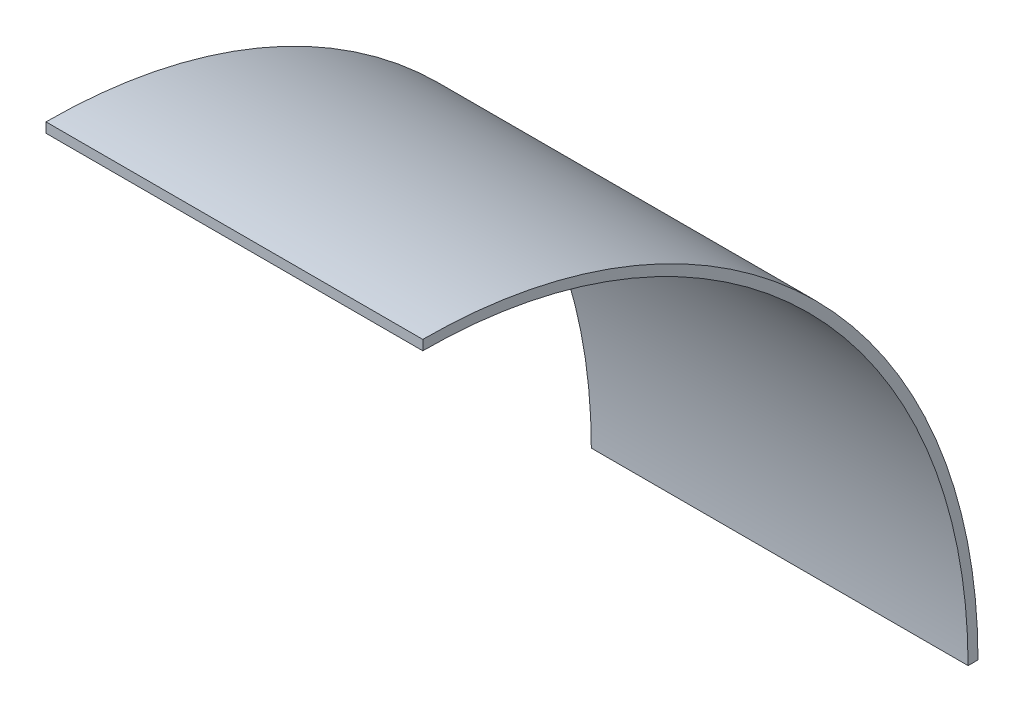
ISO-10303-21;
HEADER;
FILE_DESCRIPTION(('STEP AP214'),'2;1');
FILE_NAME('part.step','',(''),(''),'','','');
FILE_SCHEMA(('AUTOMOTIVE_DESIGN { 1 0 10303 214 1 1 1 1 }'));
ENDSEC;
DATA;
#1=APPLICATION_CONTEXT('core data for automotive mechanical design processes');
#2=APPLICATION_PROTOCOL_DEFINITION('international standard','automotive_design',2000,#1);
#3=PRODUCT_CONTEXT('',#1,'mechanical');
#4=PRODUCT('Part','Part','',(#3));
#5=PRODUCT_RELATED_PRODUCT_CATEGORY('part','',(#4));
#6=PRODUCT_DEFINITION_FORMATION('','',#4);
#7=PRODUCT_DEFINITION_CONTEXT('part definition',#1,'design');
#8=PRODUCT_DEFINITION('design','',#6,#7);
#9=PRODUCT_DEFINITION_SHAPE('','',#8);
#10=(LENGTH_UNIT() NAMED_UNIT(*) SI_UNIT(.MILLI.,.METRE.));
#11=(NAMED_UNIT(*) PLANE_ANGLE_UNIT() SI_UNIT($,.RADIAN.));
#12=(NAMED_UNIT(*) SI_UNIT($,.STERADIAN.) SOLID_ANGLE_UNIT());
#13=UNCERTAINTY_MEASURE_WITH_UNIT(LENGTH_MEASURE(1.E-05),#10,'distance_accuracy_value','');
#14=(GEOMETRIC_REPRESENTATION_CONTEXT(3) GLOBAL_UNCERTAINTY_ASSIGNED_CONTEXT((#13)) GLOBAL_UNIT_ASSIGNED_CONTEXT((#10,
#11,#12)) REPRESENTATION_CONTEXT('',''));
#15=CARTESIAN_POINT('',(0.,0.,0.));
#16=DIRECTION('',(0.,0.,1.));
#17=DIRECTION('',(1.,0.,0.));
#18=AXIS2_PLACEMENT_3D('',#15,#16,#17);
#19=CARTESIAN_POINT('',(120.65,0.,0.));
#20=DIRECTION('',(-1.,0.,0.));
#21=DIRECTION('',(0.,0.,1.));
#22=AXIS2_PLACEMENT_3D('',#19,#20,#21);
#23=CYLINDRICAL_SURFACE('',#22,174.625);
#24=CARTESIAN_POINT('',(0.,0.,0.));
#25=DIRECTION('',(-1.,0.,0.));
#26=DIRECTION('',(0.,0.,-1.));
#27=AXIS2_PLACEMENT_3D('',#24,#25,#26);
#28=CIRCLE('',#27,174.625);
#29=CARTESIAN_POINT('',(0.,174.625,0.));
#30=VERTEX_POINT('',#29);
#31=CARTESIAN_POINT('',(0.,0.,-174.625));
#32=VERTEX_POINT('',#31);
#33=EDGE_CURVE('E96',#30,#32,#28,.T.);
#34=ORIENTED_EDGE('',*,*,#33,.T.);
#35=DIRECTION('',(-1.,0.,0.));
#36=VECTOR('',#35,1.);
#37=CARTESIAN_POINT('',(120.65,0.,-174.625));
#38=LINE('',#37,#36);
#39=CARTESIAN_POINT('',(120.65,0.,-174.625));
#40=VERTEX_POINT('',#39);
#41=EDGE_CURVE('E11',#40,#32,#38,.T.);
#42=ORIENTED_EDGE('',*,*,#41,.F.);
#43=CARTESIAN_POINT('',(120.65,0.,0.));
#44=DIRECTION('',(-1.,0.,0.));
#45=DIRECTION('',(0.,0.,-1.));
#46=AXIS2_PLACEMENT_3D('',#43,#44,#45);
#47=CIRCLE('',#46,174.625);
#48=CARTESIAN_POINT('',(120.65,174.625,0.));
#49=VERTEX_POINT('',#48);
#50=EDGE_CURVE('E84',#49,#40,#47,.T.);
#51=ORIENTED_EDGE('',*,*,#50,.F.);
#52=DIRECTION('',(-1.,0.,0.));
#53=VECTOR('',#52,1.);
#54=CARTESIAN_POINT('',(120.65,174.625,0.));
#55=LINE('',#54,#53);
#56=EDGE_CURVE('E92',#49,#30,#55,.T.);
#57=ORIENTED_EDGE('',*,*,#56,.T.);
#58=EDGE_LOOP('',(#34,#42,#51,#57));
#59=FACE_BOUND('',#58,.T.);
#60=ADVANCED_FACE('F33',(#59),#23,.F.);
#61=CARTESIAN_POINT('',(120.65,0.,-174.625));
#62=DIRECTION('',(0.,1.,0.));
#63=DIRECTION('',(0.,0.,1.));
#64=AXIS2_PLACEMENT_3D('',#61,#62,#63);
#65=PLANE('',#64);
#66=DIRECTION('',(0.,0.,-1.));
#67=VECTOR('',#66,1.);
#68=CARTESIAN_POINT('',(0.,0.,-174.625));
#69=LINE('',#68,#67);
#70=CARTESIAN_POINT('',(0.,0.,-177.8));
#71=VERTEX_POINT('',#70);
#72=EDGE_CURVE('E88',#32,#71,#69,.T.);
#73=ORIENTED_EDGE('',*,*,#72,.T.);
#74=DIRECTION('',(-1.,0.,0.));
#75=VECTOR('',#74,1.);
#76=CARTESIAN_POINT('',(120.65,0.,-177.8));
#77=LINE('',#76,#75);
#78=CARTESIAN_POINT('',(120.65,0.,-177.8));
#79=VERTEX_POINT('',#78);
#80=EDGE_CURVE('E41',#79,#71,#77,.T.);
#81=ORIENTED_EDGE('',*,*,#80,.F.);
#82=DIRECTION('',(0.,0.,-1.));
#83=VECTOR('',#82,1.);
#84=CARTESIAN_POINT('',(120.65,0.,-174.625));
#85=LINE('',#84,#83);
#86=EDGE_CURVE('E79',#40,#79,#85,.T.);
#87=ORIENTED_EDGE('',*,*,#86,.F.);
#88=ORIENTED_EDGE('',*,*,#41,.T.);
#89=EDGE_LOOP('',(#73,#81,#87,#88));
#90=FACE_BOUND('',#89,.T.);
#91=ADVANCED_FACE('F87',(#90),#65,.F.);
#92=CARTESIAN_POINT('',(120.65,0.,0.));
#93=DIRECTION('',(-1.,0.,0.));
#94=DIRECTION('',(0.,0.,1.));
#95=AXIS2_PLACEMENT_3D('',#92,#93,#94);
#96=CYLINDRICAL_SURFACE('',#95,177.8);
#97=CARTESIAN_POINT('',(0.,0.,0.));
#98=DIRECTION('',(1.,0.,0.));
#99=DIRECTION('',(0.,0.,-1.));
#100=AXIS2_PLACEMENT_3D('',#97,#98,#99);
#101=CIRCLE('',#100,177.8);
#102=CARTESIAN_POINT('',(0.,177.8,0.));
#103=VERTEX_POINT('',#102);
#104=EDGE_CURVE('E66',#71,#103,#101,.T.);
#105=ORIENTED_EDGE('',*,*,#104,.T.);
#106=DIRECTION('',(-1.,0.,0.));
#107=VECTOR('',#106,1.);
#108=CARTESIAN_POINT('',(120.65,177.8,0.));
#109=LINE('',#108,#107);
#110=CARTESIAN_POINT('',(120.65,177.8,0.));
#111=VERTEX_POINT('',#110);
#112=EDGE_CURVE('E89',#111,#103,#109,.T.);
#113=ORIENTED_EDGE('',*,*,#112,.F.);
#114=CARTESIAN_POINT('',(120.65,0.,0.));
#115=DIRECTION('',(1.,0.,0.));
#116=DIRECTION('',(0.,0.,-1.));
#117=AXIS2_PLACEMENT_3D('',#114,#115,#116);
#118=CIRCLE('',#117,177.8);
#119=EDGE_CURVE('E82',#79,#111,#118,.T.);
#120=ORIENTED_EDGE('',*,*,#119,.F.);
#121=ORIENTED_EDGE('',*,*,#80,.T.);
#122=EDGE_LOOP('',(#105,#113,#120,#121));
#123=FACE_BOUND('',#122,.T.);
#124=ADVANCED_FACE('F90',(#123),#96,.T.);
#125=CARTESIAN_POINT('',(120.65,174.625,0.));
#126=DIRECTION('',(0.,0.,-1.));
#127=DIRECTION('',(-1.,0.,0.));
#128=AXIS2_PLACEMENT_3D('',#125,#126,#127);
#129=PLANE('',#128);
#130=DIRECTION('',(0.,-1.,0.));
#131=VECTOR('',#130,1.);
#132=CARTESIAN_POINT('',(0.,174.625,0.));
#133=LINE('',#132,#131);
#134=EDGE_CURVE('E72',#103,#30,#133,.T.);
#135=ORIENTED_EDGE('',*,*,#134,.T.);
#136=ORIENTED_EDGE('',*,*,#56,.F.);
#137=DIRECTION('',(0.,-1.,0.));
#138=VECTOR('',#137,1.);
#139=CARTESIAN_POINT('',(120.65,174.625,0.));
#140=LINE('',#139,#138);
#141=EDGE_CURVE('E49',#111,#49,#140,.T.);
#142=ORIENTED_EDGE('',*,*,#141,.F.);
#143=ORIENTED_EDGE('',*,*,#112,.T.);
#144=EDGE_LOOP('',(#135,#136,#142,#143));
#145=FACE_BOUND('',#144,.T.);
#146=ADVANCED_FACE('F103',(#145),#129,.F.);
#147=CARTESIAN_POINT('',(120.65,0.,0.));
#148=DIRECTION('',(1.,0.,0.));
#149=DIRECTION('',(0.,0.,-1.));
#150=AXIS2_PLACEMENT_3D('',#147,#148,#149);
#151=PLANE('',#150);
#152=ORIENTED_EDGE('',*,*,#50,.T.);
#153=ORIENTED_EDGE('',*,*,#86,.T.);
#154=ORIENTED_EDGE('',*,*,#119,.T.);
#155=ORIENTED_EDGE('',*,*,#141,.T.);
#156=EDGE_LOOP('',(#152,#153,#154,#155));
#157=FACE_BOUND('',#156,.T.);
#158=ADVANCED_FACE('F80',(#157),#151,.T.);
#159=CARTESIAN_POINT('',(0.,0.,0.));
#160=DIRECTION('',(1.,0.,0.));
#161=DIRECTION('',(0.,0.,-1.));
#162=AXIS2_PLACEMENT_3D('',#159,#160,#161);
#163=PLANE('',#162);
#164=ORIENTED_EDGE('',*,*,#33,.F.);
#165=ORIENTED_EDGE('',*,*,#134,.F.);
#166=ORIENTED_EDGE('',*,*,#104,.F.);
#167=ORIENTED_EDGE('',*,*,#72,.F.);
#168=EDGE_LOOP('',(#164,#165,#166,#167));
#169=FACE_BOUND('',#168,.T.);
#170=ADVANCED_FACE('F106',(#169),#163,.F.);
#171=CLOSED_SHELL('',(#60,#91,#124,#146,#158,#170));
#172=MANIFOLD_SOLID_BREP('B2',#171);
#173=ADVANCED_BREP_SHAPE_REPRESENTATION('',(#18,#172),#14);
#174=SHAPE_DEFINITION_REPRESENTATION(#9,#173);
ENDSEC;
END-ISO-10303-21;
